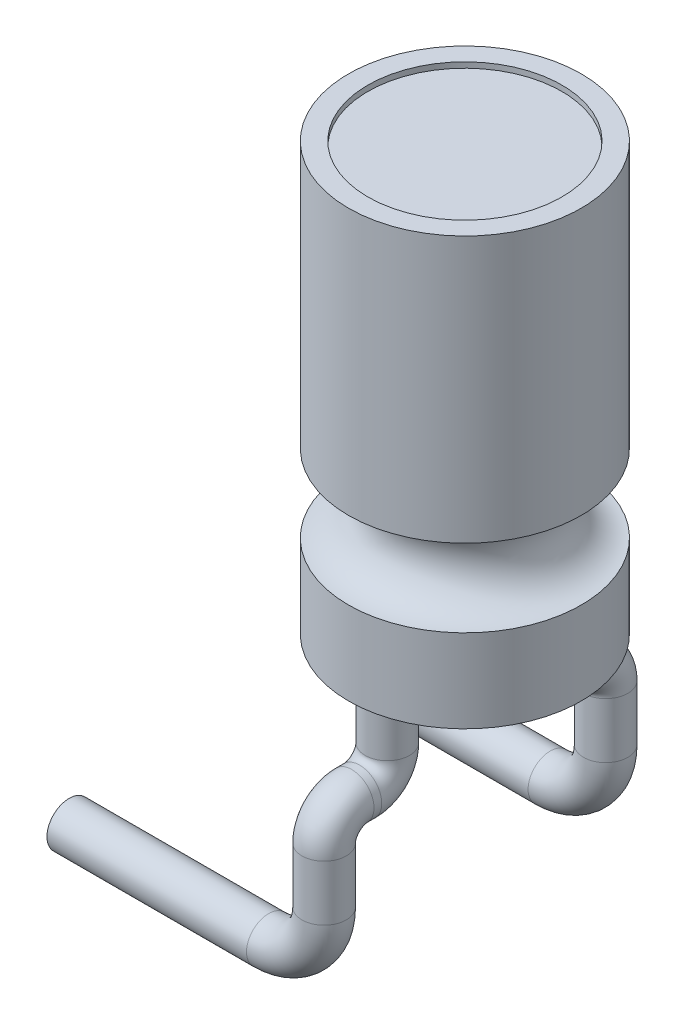
ISO-10303-21;
HEADER;
FILE_DESCRIPTION(('STEP AP214'),'2;1');
FILE_NAME('part.step','',(''),(''),'','','');
FILE_SCHEMA(('AUTOMOTIVE_DESIGN { 1 0 10303 214 1 1 1 1 }'));
ENDSEC;
DATA;
#1=APPLICATION_CONTEXT('core data for automotive mechanical design processes');
#2=APPLICATION_PROTOCOL_DEFINITION('international standard','automotive_design',2000,#1);
#3=PRODUCT_CONTEXT('',#1,'mechanical');
#4=PRODUCT('Part','Part','',(#3));
#5=PRODUCT_RELATED_PRODUCT_CATEGORY('part','',(#4));
#6=PRODUCT_DEFINITION_FORMATION('','',#4);
#7=PRODUCT_DEFINITION_CONTEXT('part definition',#1,'design');
#8=PRODUCT_DEFINITION('design','',#6,#7);
#9=PRODUCT_DEFINITION_SHAPE('','',#8);
#10=(LENGTH_UNIT() NAMED_UNIT(*) SI_UNIT(.MILLI.,.METRE.));
#11=(NAMED_UNIT(*) PLANE_ANGLE_UNIT() SI_UNIT($,.RADIAN.));
#12=(NAMED_UNIT(*) SI_UNIT($,.STERADIAN.) SOLID_ANGLE_UNIT());
#13=UNCERTAINTY_MEASURE_WITH_UNIT(LENGTH_MEASURE(1.E-05),#10,'distance_accuracy_value','');
#14=(GEOMETRIC_REPRESENTATION_CONTEXT(3) GLOBAL_UNCERTAINTY_ASSIGNED_CONTEXT((#13)) GLOBAL_UNIT_ASSIGNED_CONTEXT((#10,
#11,#12)) REPRESENTATION_CONTEXT('',''));
#15=CARTESIAN_POINT('',(0.,0.,0.));
#16=DIRECTION('',(0.,0.,1.));
#17=DIRECTION('',(1.,0.,0.));
#18=AXIS2_PLACEMENT_3D('',#15,#16,#17);
#19=CARTESIAN_POINT('',(2.1,27.5164236634825,0.));
#20=DIRECTION('',(0.,1.,0.));
#21=DIRECTION('',(0.,0.,1.));
#22=AXIS2_PLACEMENT_3D('',#19,#20,#21);
#23=PLANE('',#22);
#24=CARTESIAN_POINT('',(0.,27.5164236634825,-1.4));
#25=DIRECTION('',(0.,1.,0.));
#26=DIRECTION('',(0.,0.,1.));
#27=AXIS2_PLACEMENT_3D('',#24,#25,#26);
#28=CIRCLE('',#27,0.4);
#29=CARTESIAN_POINT('',(0.,27.5164236634825,-1.));
#30=VERTEX_POINT('',#29);
#31=EDGE_CURVE('E84',#30,#30,#28,.T.);
#32=ORIENTED_EDGE('',*,*,#31,.T.);
#33=EDGE_LOOP('',(#32));
#34=FACE_BOUND('',#33,.T.);
#35=CARTESIAN_POINT('',(0.,27.5164236634825,0.));
#36=DIRECTION('',(0.,1.,0.));
#37=DIRECTION('',(0.,0.,1.));
#38=AXIS2_PLACEMENT_3D('',#35,#36,#37);
#39=CIRCLE('',#38,2.1);
#40=CARTESIAN_POINT('',(0.,27.5164236634825,2.1));
#41=VERTEX_POINT('',#40);
#42=EDGE_CURVE('E32',#41,#41,#39,.T.);
#43=ORIENTED_EDGE('',*,*,#42,.F.);
#44=EDGE_LOOP('',(#43));
#45=FACE_BOUND('',#44,.T.);
#46=CARTESIAN_POINT('',(0.,27.5164236634825,1.4));
#47=DIRECTION('',(0.,1.,0.));
#48=DIRECTION('',(0.,0.,1.));
#49=AXIS2_PLACEMENT_3D('',#46,#47,#48);
#50=CIRCLE('',#49,0.4);
#51=CARTESIAN_POINT('',(0.,27.5164236634825,1.8));
#52=VERTEX_POINT('',#51);
#53=EDGE_CURVE('E10',#52,#52,#50,.F.);
#54=ORIENTED_EDGE('',*,*,#53,.F.);
#55=EDGE_LOOP('',(#54));
#56=FACE_BOUND('',#55,.T.);
#57=ADVANCED_FACE('F26',(#34,#45,#56),#23,.F.);
#58=CARTESIAN_POINT('',(0.,48.4017094017094,0.));
#59=DIRECTION('',(0.,1.,0.));
#60=DIRECTION('',(0.,0.,1.));
#61=AXIS2_PLACEMENT_3D('',#58,#59,#60);
#62=CYLINDRICAL_SURFACE('',#61,2.1);
#63=CARTESIAN_POINT('',(0.,29.0164236634825,0.));
#64=DIRECTION('',(0.,1.,0.));
#65=DIRECTION('',(0.,0.,1.));
#66=AXIS2_PLACEMENT_3D('',#63,#64,#65);
#67=CIRCLE('',#66,2.1);
#68=CARTESIAN_POINT('',(0.,29.0164236634825,2.1));
#69=VERTEX_POINT('',#68);
#70=EDGE_CURVE('E36',#69,#69,#67,.T.);
#71=ORIENTED_EDGE('',*,*,#70,.F.);
#72=EDGE_LOOP('',(#71));
#73=FACE_BOUND('',#72,.T.);
#74=ORIENTED_EDGE('',*,*,#42,.T.);
#75=EDGE_LOOP('',(#74));
#76=FACE_BOUND('',#75,.T.);
#77=ADVANCED_FACE('F118',(#73,#76),#62,.T.);
#78=CARTESIAN_POINT('',(0.,29.7164236634825,0.));
#79=DIRECTION('',(0.,1.,0.));
#80=DIRECTION('',(0.,0.,1.));
#81=AXIS2_PLACEMENT_3D('',#78,#79,#80);
#82=TOROIDAL_SURFACE('',#81,2.1,0.699999999999999);
#83=CARTESIAN_POINT('',(0.,30.4164236634825,0.));
#84=DIRECTION('',(0.,1.,0.));
#85=DIRECTION('',(0.,0.,1.));
#86=AXIS2_PLACEMENT_3D('',#83,#84,#85);
#87=CIRCLE('',#86,2.1);
#88=CARTESIAN_POINT('',(0.,30.4164236634825,2.1));
#89=VERTEX_POINT('',#88);
#90=EDGE_CURVE('E40',#89,#89,#87,.T.);
#91=ORIENTED_EDGE('',*,*,#90,.F.);
#92=EDGE_LOOP('',(#91));
#93=FACE_BOUND('',#92,.T.);
#94=ORIENTED_EDGE('',*,*,#70,.T.);
#95=EDGE_LOOP('',(#94));
#96=FACE_BOUND('',#95,.T.);
#97=ADVANCED_FACE('F125',(#93,#96),#82,.F.);
#98=CARTESIAN_POINT('',(0.,48.4017094017094,0.));
#99=DIRECTION('',(0.,1.,0.));
#100=DIRECTION('',(0.,0.,1.));
#101=AXIS2_PLACEMENT_3D('',#98,#99,#100);
#102=CYLINDRICAL_SURFACE('',#101,2.1);
#103=CARTESIAN_POINT('',(0.,35.2164236634825,0.));
#104=DIRECTION('',(0.,1.,0.));
#105=DIRECTION('',(0.,0.,1.));
#106=AXIS2_PLACEMENT_3D('',#103,#104,#105);
#107=CIRCLE('',#106,2.1);
#108=CARTESIAN_POINT('',(0.,35.2164236634825,2.1));
#109=VERTEX_POINT('',#108);
#110=EDGE_CURVE('E45',#109,#109,#107,.T.);
#111=ORIENTED_EDGE('',*,*,#110,.F.);
#112=EDGE_LOOP('',(#111));
#113=FACE_BOUND('',#112,.T.);
#114=ORIENTED_EDGE('',*,*,#90,.T.);
#115=EDGE_LOOP('',(#114));
#116=FACE_BOUND('',#115,.T.);
#117=ADVANCED_FACE('F193',(#113,#116),#102,.T.);
#118=CARTESIAN_POINT('',(0.,35.2164236634825,0.));
#119=DIRECTION('',(0.,-1.,0.));
#120=DIRECTION('',(0.,0.,-1.));
#121=AXIS2_PLACEMENT_3D('',#118,#119,#120);
#122=PLANE('',#121);
#123=CARTESIAN_POINT('',(0.,35.2164236634825,0.));
#124=DIRECTION('',(0.,1.,0.));
#125=DIRECTION('',(0.,0.,1.));
#126=AXIS2_PLACEMENT_3D('',#123,#124,#125);
#127=CIRCLE('',#126,1.75);
#128=CARTESIAN_POINT('',(0.,35.2164236634825,1.75));
#129=VERTEX_POINT('',#128);
#130=EDGE_CURVE('E51',#129,#129,#127,.T.);
#131=ORIENTED_EDGE('',*,*,#130,.F.);
#132=EDGE_LOOP('',(#131));
#133=FACE_BOUND('',#132,.T.);
#134=ORIENTED_EDGE('',*,*,#110,.T.);
#135=EDGE_LOOP('',(#134));
#136=FACE_BOUND('',#135,.T.);
#137=ADVANCED_FACE('F189',(#133,#136),#122,.F.);
#138=CARTESIAN_POINT('',(0.,35.1164236634825,0.));
#139=DIRECTION('',(0.,1.,0.));
#140=DIRECTION('',(0.,0.,1.));
#141=AXIS2_PLACEMENT_3D('',#138,#139,#140);
#142=CYLINDRICAL_SURFACE('',#141,1.75);
#143=CARTESIAN_POINT('',(0.,35.1164236634825,0.));
#144=DIRECTION('',(0.,1.,0.));
#145=DIRECTION('',(0.,0.,1.));
#146=AXIS2_PLACEMENT_3D('',#143,#144,#145);
#147=CIRCLE('',#146,1.75);
#148=CARTESIAN_POINT('',(0.,35.1164236634825,1.75));
#149=VERTEX_POINT('',#148);
#150=EDGE_CURVE('E48',#149,#149,#147,.T.);
#151=ORIENTED_EDGE('',*,*,#150,.F.);
#152=EDGE_LOOP('',(#151));
#153=FACE_BOUND('',#152,.T.);
#154=ORIENTED_EDGE('',*,*,#130,.T.);
#155=EDGE_LOOP('',(#154));
#156=FACE_BOUND('',#155,.T.);
#157=ADVANCED_FACE('F185',(#153,#156),#142,.F.);
#158=CARTESIAN_POINT('',(0.,35.1164236634825,0.));
#159=DIRECTION('',(0.,1.,0.));
#160=DIRECTION('',(0.,0.,1.));
#161=AXIS2_PLACEMENT_3D('',#158,#159,#160);
#162=PLANE('',#161);
#163=ORIENTED_EDGE('',*,*,#150,.T.);
#164=EDGE_LOOP('',(#163));
#165=FACE_BOUND('',#164,.T.);
#166=ADVANCED_FACE('F181',(#165),#162,.T.);
#167=CARTESIAN_POINT('',(0.,25.5164236634825,2.04));
#168=DIRECTION('',(1.,0.,0.));
#169=DIRECTION('',(0.,0.,-1.));
#170=AXIS2_PLACEMENT_3D('',#167,#168,#169);
#171=TOROIDAL_SURFACE('',#170,0.500000000000004,0.4);
#172=CARTESIAN_POINT('',(0.,26.0164236634825,2.04));
#173=DIRECTION('',(0.,0.,1.));
#174=DIRECTION('',(0.,-1.,0.));
#175=AXIS2_PLACEMENT_3D('',#172,#173,#174);
#176=CIRCLE('',#175,0.4);
#177=CARTESIAN_POINT('',(0.,26.4164236634825,2.03999999999999));
#178=VERTEX_POINT('',#177);
#179=EDGE_CURVE('E57',#178,#178,#176,.T.);
#180=CARTESIAN_POINT('',(0.,25.5164236634825,2.54));
#181=DIRECTION('',(0.,-1.,0.));
#182=DIRECTION('',(0.,0.,-1.));
#183=AXIS2_PLACEMENT_3D('',#180,#181,#182);
#184=CIRCLE('',#183,0.4);
#185=CARTESIAN_POINT('',(0.,25.5164236634825,2.94));
#186=VERTEX_POINT('',#185);
#187=EDGE_CURVE('E54',#186,#186,#184,.T.);
#188=CARTESIAN_POINT('',(0.,25.5164236634825,2.04));
#189=DIRECTION('',(1.,0.,0.));
#190=DIRECTION('',(0.,0.,-1.));
#191=AXIS2_PLACEMENT_3D('',#188,#189,#190);
#192=CIRCLE('',#191,0.900000000000004);
#193=EDGE_CURVE('',#178,#186,#192,.T.);
#194=ORIENTED_EDGE('',*,*,#179,.T.);
#195=ORIENTED_EDGE('',*,*,#187,.F.);
#196=ORIENTED_EDGE('',*,*,#193,.T.);
#197=ORIENTED_EDGE('',*,*,#193,.F.);
#198=EDGE_LOOP('',(#194,#196,#195,#197));
#199=FACE_BOUND('',#198,.T.);
#200=ADVANCED_FACE('F177',(#199),#171,.T.);
#201=CARTESIAN_POINT('',(0.,26.0164236634825,1.9));
#202=DIRECTION('',(0.,0.,1.));
#203=DIRECTION('',(1.,0.,0.));
#204=AXIS2_PLACEMENT_3D('',#201,#202,#203);
#205=CYLINDRICAL_SURFACE('',#204,0.4);
#206=CARTESIAN_POINT('',(0.,26.0164236634825,1.9));
#207=DIRECTION('',(0.,0.,1.));
#208=DIRECTION('',(0.,-1.,0.));
#209=AXIS2_PLACEMENT_3D('',#206,#207,#208);
#210=CIRCLE('',#209,0.4);
#211=CARTESIAN_POINT('',(0.,25.6164236634825,1.9));
#212=VERTEX_POINT('',#211);
#213=EDGE_CURVE('E60',#212,#212,#210,.T.);
#214=ORIENTED_EDGE('',*,*,#213,.T.);
#215=EDGE_LOOP('',(#214));
#216=FACE_BOUND('',#215,.T.);
#217=ORIENTED_EDGE('',*,*,#179,.F.);
#218=EDGE_LOOP('',(#217));
#219=FACE_BOUND('',#218,.T.);
#220=ADVANCED_FACE('F173',(#216,#219),#205,.T.);
#221=CARTESIAN_POINT('',(0.,26.5164236634825,1.9));
#222=DIRECTION('',(-1.,0.,0.));
#223=DIRECTION('',(0.,0.,1.));
#224=AXIS2_PLACEMENT_3D('',#221,#222,#223);
#225=TOROIDAL_SURFACE('',#224,0.5,0.4);
#226=CARTESIAN_POINT('',(0.,26.5164236634825,1.4));
#227=DIRECTION('',(0.,-1.,0.));
#228=DIRECTION('',(0.,0.,-1.));
#229=AXIS2_PLACEMENT_3D('',#226,#227,#228);
#230=CIRCLE('',#229,0.4);
#231=CARTESIAN_POINT('',(0.,26.5164236634825,1.));
#232=VERTEX_POINT('',#231);
#233=EDGE_CURVE('E63',#232,#232,#230,.T.);
#234=CARTESIAN_POINT('',(0.,26.5164236634825,1.9));
#235=DIRECTION('',(-1.,0.,0.));
#236=DIRECTION('',(0.,0.,1.));
#237=AXIS2_PLACEMENT_3D('',#234,#235,#236);
#238=CIRCLE('',#237,0.9);
#239=EDGE_CURVE('',#232,#212,#238,.T.);
#240=ORIENTED_EDGE('',*,*,#233,.T.);
#241=ORIENTED_EDGE('',*,*,#213,.F.);
#242=ORIENTED_EDGE('',*,*,#239,.T.);
#243=ORIENTED_EDGE('',*,*,#239,.F.);
#244=EDGE_LOOP('',(#240,#242,#241,#243));
#245=FACE_BOUND('',#244,.T.);
#246=ADVANCED_FACE('F169',(#245),#225,.T.);
#247=CARTESIAN_POINT('',(0.,26.5164236634825,1.4));
#248=DIRECTION('',(0.,1.,0.));
#249=DIRECTION('',(0.,0.,1.));
#250=AXIS2_PLACEMENT_3D('',#247,#248,#249);
#251=CYLINDRICAL_SURFACE('',#250,0.4);
#252=ORIENTED_EDGE('',*,*,#233,.F.);
#253=EDGE_LOOP('',(#252));
#254=FACE_BOUND('',#253,.T.);
#255=ORIENTED_EDGE('',*,*,#53,.T.);
#256=EDGE_LOOP('',(#255));
#257=FACE_BOUND('',#256,.T.);
#258=ADVANCED_FACE('F165',(#254,#257),#251,.T.);
#259=CARTESIAN_POINT('',(-1.00000000000001,23.5164236634825,2.54));
#260=DIRECTION('',(-1.,0.,0.));
#261=DIRECTION('',(0.,0.,1.));
#262=AXIS2_PLACEMENT_3D('',#259,#260,#261);
#263=CYLINDRICAL_SURFACE('',#262,0.4);
#264=CARTESIAN_POINT('',(-1.00000000000001,23.5164236634825,2.54));
#265=DIRECTION('',(-1.,0.,0.));
#266=DIRECTION('',(0.,0.,-1.));
#267=AXIS2_PLACEMENT_3D('',#264,#265,#266);
#268=CIRCLE('',#267,0.4);
#269=CARTESIAN_POINT('',(-1.00000000000001,23.1164236634825,2.54));
#270=VERTEX_POINT('',#269);
#271=EDGE_CURVE('E69',#270,#270,#268,.T.);
#272=ORIENTED_EDGE('',*,*,#271,.T.);
#273=EDGE_LOOP('',(#272));
#274=FACE_BOUND('',#273,.T.);
#275=CARTESIAN_POINT('',(-4.6,23.5164236634825,2.54));
#276=DIRECTION('',(-1.,0.,0.));
#277=DIRECTION('',(0.,0.,-1.));
#278=AXIS2_PLACEMENT_3D('',#275,#276,#277);
#279=CIRCLE('',#278,0.4);
#280=CARTESIAN_POINT('',(-4.6,23.5164236634825,2.14));
#281=VERTEX_POINT('',#280);
#282=EDGE_CURVE('E66',#281,#281,#279,.T.);
#283=ORIENTED_EDGE('',*,*,#282,.F.);
#284=EDGE_LOOP('',(#283));
#285=FACE_BOUND('',#284,.T.);
#286=ADVANCED_FACE('F161',(#274,#285),#263,.T.);
#287=CARTESIAN_POINT('',(-1.,24.5164236634825,2.54));
#288=DIRECTION('',(0.,0.,-1.));
#289=DIRECTION('',(-1.,0.,0.));
#290=AXIS2_PLACEMENT_3D('',#287,#288,#289);
#291=TOROIDAL_SURFACE('',#290,1.,0.4);
#292=CARTESIAN_POINT('',(0.,24.5164236634825,2.54));
#293=DIRECTION('',(0.,-1.,0.));
#294=DIRECTION('',(0.,0.,-1.));
#295=AXIS2_PLACEMENT_3D('',#292,#293,#294);
#296=CIRCLE('',#295,0.4);
#297=CARTESIAN_POINT('',(0.4,24.5164236634825,2.54));
#298=VERTEX_POINT('',#297);
#299=EDGE_CURVE('E72',#298,#298,#296,.T.);
#300=CARTESIAN_POINT('',(-1.,24.5164236634825,2.54));
#301=DIRECTION('',(0.,0.,-1.));
#302=DIRECTION('',(-1.,0.,0.));
#303=AXIS2_PLACEMENT_3D('',#300,#301,#302);
#304=CIRCLE('',#303,1.4);
#305=EDGE_CURVE('',#298,#270,#304,.T.);
#306=ORIENTED_EDGE('',*,*,#299,.T.);
#307=ORIENTED_EDGE('',*,*,#271,.F.);
#308=ORIENTED_EDGE('',*,*,#305,.T.);
#309=ORIENTED_EDGE('',*,*,#305,.F.);
#310=EDGE_LOOP('',(#306,#308,#307,#309));
#311=FACE_BOUND('',#310,.T.);
#312=ADVANCED_FACE('F157',(#311),#291,.T.);
#313=CARTESIAN_POINT('',(0.,24.5164236634825,2.54));
#314=DIRECTION('',(0.,1.,0.));
#315=DIRECTION('',(-1.,0.,0.));
#316=AXIS2_PLACEMENT_3D('',#313,#314,#315);
#317=CYLINDRICAL_SURFACE('',#316,0.4);
#318=ORIENTED_EDGE('',*,*,#299,.F.);
#319=EDGE_LOOP('',(#318));
#320=FACE_BOUND('',#319,.T.);
#321=ORIENTED_EDGE('',*,*,#187,.T.);
#322=EDGE_LOOP('',(#321));
#323=FACE_BOUND('',#322,.T.);
#324=ADVANCED_FACE('F153',(#320,#323),#317,.T.);
#325=CARTESIAN_POINT('',(-4.6,23.5164236634825,2.54));
#326=DIRECTION('',(-1.,0.,0.));
#327=DIRECTION('',(0.,0.,-1.));
#328=AXIS2_PLACEMENT_3D('',#325,#326,#327);
#329=PLANE('',#328);
#330=ORIENTED_EDGE('',*,*,#282,.T.);
#331=EDGE_LOOP('',(#330));
#332=FACE_BOUND('',#331,.T.);
#333=ADVANCED_FACE('F150',(#332),#329,.T.);
#334=CARTESIAN_POINT('',(0.,25.5164236634825,-2.04));
#335=DIRECTION('',(-1.,0.,0.));
#336=DIRECTION('',(0.,0.,1.));
#337=AXIS2_PLACEMENT_3D('',#334,#335,#336);
#338=TOROIDAL_SURFACE('',#337,0.500000000000004,0.4);
#339=CARTESIAN_POINT('',(0.,26.0164236634825,-2.04));
#340=DIRECTION('',(0.,0.,1.));
#341=DIRECTION('',(0.,-1.,0.));
#342=AXIS2_PLACEMENT_3D('',#339,#340,#341);
#343=CIRCLE('',#342,0.4);
#344=CARTESIAN_POINT('',(0.,26.4164236634825,-2.03999999999999));
#345=VERTEX_POINT('',#344);
#346=EDGE_CURVE('E75',#345,#345,#343,.T.);
#347=CARTESIAN_POINT('',(0.,25.5164236634825,-2.54));
#348=DIRECTION('',(0.,1.,0.));
#349=DIRECTION('',(0.,0.,1.));
#350=AXIS2_PLACEMENT_3D('',#347,#348,#349);
#351=CIRCLE('',#350,0.4);
#352=CARTESIAN_POINT('',(0.,25.5164236634825,-2.94));
#353=VERTEX_POINT('',#352);
#354=EDGE_CURVE('E96',#353,#353,#351,.T.);
#355=CARTESIAN_POINT('',(0.,25.5164236634825,-2.04));
#356=DIRECTION('',(-1.,0.,0.));
#357=DIRECTION('',(0.,0.,1.));
#358=AXIS2_PLACEMENT_3D('',#355,#356,#357);
#359=CIRCLE('',#358,0.900000000000004);
#360=EDGE_CURVE('',#345,#353,#359,.T.);
#361=ORIENTED_EDGE('',*,*,#346,.F.);
#362=ORIENTED_EDGE('',*,*,#354,.T.);
#363=ORIENTED_EDGE('',*,*,#360,.T.);
#364=ORIENTED_EDGE('',*,*,#360,.F.);
#365=EDGE_LOOP('',(#361,#363,#362,#364));
#366=FACE_BOUND('',#365,.T.);
#367=ADVANCED_FACE('F100',(#366),#338,.T.);
#368=CARTESIAN_POINT('',(0.,26.0164236634825,-1.9));
#369=DIRECTION('',(0.,0.,-1.));
#370=DIRECTION('',(-1.,0.,0.));
#371=AXIS2_PLACEMENT_3D('',#368,#369,#370);
#372=CYLINDRICAL_SURFACE('',#371,0.4);
#373=CARTESIAN_POINT('',(0.,26.0164236634825,-1.9));
#374=DIRECTION('',(0.,0.,1.));
#375=DIRECTION('',(0.,-1.,0.));
#376=AXIS2_PLACEMENT_3D('',#373,#374,#375);
#377=CIRCLE('',#376,0.4);
#378=CARTESIAN_POINT('',(0.,25.6164236634825,-1.9));
#379=VERTEX_POINT('',#378);
#380=EDGE_CURVE('E78',#379,#379,#377,.T.);
#381=ORIENTED_EDGE('',*,*,#380,.F.);
#382=EDGE_LOOP('',(#381));
#383=FACE_BOUND('',#382,.T.);
#384=ORIENTED_EDGE('',*,*,#346,.T.);
#385=EDGE_LOOP('',(#384));
#386=FACE_BOUND('',#385,.T.);
#387=ADVANCED_FACE('F142',(#383,#386),#372,.T.);
#388=CARTESIAN_POINT('',(0.,26.5164236634825,-1.9));
#389=DIRECTION('',(1.,0.,0.));
#390=DIRECTION('',(0.,0.,-1.));
#391=AXIS2_PLACEMENT_3D('',#388,#389,#390);
#392=TOROIDAL_SURFACE('',#391,0.5,0.4);
#393=CARTESIAN_POINT('',(0.,26.5164236634825,-1.4));
#394=DIRECTION('',(0.,1.,0.));
#395=DIRECTION('',(0.,0.,1.));
#396=AXIS2_PLACEMENT_3D('',#393,#394,#395);
#397=CIRCLE('',#396,0.4);
#398=CARTESIAN_POINT('',(0.,26.5164236634825,-1.));
#399=VERTEX_POINT('',#398);
#400=EDGE_CURVE('E81',#399,#399,#397,.T.);
#401=CARTESIAN_POINT('',(0.,26.5164236634825,-1.9));
#402=DIRECTION('',(1.,0.,0.));
#403=DIRECTION('',(0.,0.,-1.));
#404=AXIS2_PLACEMENT_3D('',#401,#402,#403);
#405=CIRCLE('',#404,0.9);
#406=EDGE_CURVE('',#399,#379,#405,.T.);
#407=ORIENTED_EDGE('',*,*,#400,.F.);
#408=ORIENTED_EDGE('',*,*,#380,.T.);
#409=ORIENTED_EDGE('',*,*,#406,.T.);
#410=ORIENTED_EDGE('',*,*,#406,.F.);
#411=EDGE_LOOP('',(#407,#409,#408,#410));
#412=FACE_BOUND('',#411,.T.);
#413=ADVANCED_FACE('F133',(#412),#392,.T.);
#414=CARTESIAN_POINT('',(0.,26.5164236634825,-1.4));
#415=DIRECTION('',(0.,1.,0.));
#416=DIRECTION('',(0.,0.,1.));
#417=AXIS2_PLACEMENT_3D('',#414,#415,#416);
#418=CYLINDRICAL_SURFACE('',#417,0.4);
#419=ORIENTED_EDGE('',*,*,#400,.T.);
#420=EDGE_LOOP('',(#419));
#421=FACE_BOUND('',#420,.T.);
#422=ORIENTED_EDGE('',*,*,#31,.F.);
#423=EDGE_LOOP('',(#422));
#424=FACE_BOUND('',#423,.T.);
#425=ADVANCED_FACE('F131',(#421,#424),#418,.T.);
#426=CARTESIAN_POINT('',(-1.00000000000001,23.5164236634825,-2.54));
#427=DIRECTION('',(-1.,0.,0.));
#428=DIRECTION('',(0.,0.,1.));
#429=AXIS2_PLACEMENT_3D('',#426,#427,#428);
#430=CYLINDRICAL_SURFACE('',#429,0.4);
#431=CARTESIAN_POINT('',(-1.00000000000001,23.5164236634825,-2.54));
#432=DIRECTION('',(1.,0.,0.));
#433=DIRECTION('',(0.,0.,1.));
#434=AXIS2_PLACEMENT_3D('',#431,#432,#433);
#435=CIRCLE('',#434,0.4);
#436=CARTESIAN_POINT('',(-1.00000000000001,23.1164236634825,-2.54));
#437=VERTEX_POINT('',#436);
#438=EDGE_CURVE('E90',#437,#437,#435,.T.);
#439=ORIENTED_EDGE('',*,*,#438,.F.);
#440=EDGE_LOOP('',(#439));
#441=FACE_BOUND('',#440,.T.);
#442=CARTESIAN_POINT('',(-4.6,23.5164236634825,-2.54));
#443=DIRECTION('',(1.,0.,0.));
#444=DIRECTION('',(0.,0.,1.));
#445=AXIS2_PLACEMENT_3D('',#442,#443,#444);
#446=CIRCLE('',#445,0.4);
#447=CARTESIAN_POINT('',(-4.6,23.5164236634825,-2.14));
#448=VERTEX_POINT('',#447);
#449=EDGE_CURVE('E87',#448,#448,#446,.T.);
#450=ORIENTED_EDGE('',*,*,#449,.T.);
#451=EDGE_LOOP('',(#450));
#452=FACE_BOUND('',#451,.T.);
#453=ADVANCED_FACE('F114',(#441,#452),#430,.T.);
#454=CARTESIAN_POINT('',(-1.,24.5164236634825,-2.54));
#455=DIRECTION('',(0.,0.,-1.));
#456=DIRECTION('',(-1.,0.,0.));
#457=AXIS2_PLACEMENT_3D('',#454,#455,#456);
#458=TOROIDAL_SURFACE('',#457,1.,0.4);
#459=CARTESIAN_POINT('',(0.,24.5164236634825,-2.54));
#460=DIRECTION('',(0.,1.,0.));
#461=DIRECTION('',(0.,0.,1.));
#462=AXIS2_PLACEMENT_3D('',#459,#460,#461);
#463=CIRCLE('',#462,0.4);
#464=CARTESIAN_POINT('',(0.4,24.5164236634825,-2.54));
#465=VERTEX_POINT('',#464);
#466=EDGE_CURVE('E93',#465,#465,#463,.T.);
#467=CARTESIAN_POINT('',(-1.,24.5164236634825,-2.54));
#468=DIRECTION('',(0.,0.,-1.));
#469=DIRECTION('',(-1.,0.,0.));
#470=AXIS2_PLACEMENT_3D('',#467,#468,#469);
#471=CIRCLE('',#470,1.4);
#472=EDGE_CURVE('',#465,#437,#471,.T.);
#473=ORIENTED_EDGE('',*,*,#466,.F.);
#474=ORIENTED_EDGE('',*,*,#438,.T.);
#475=ORIENTED_EDGE('',*,*,#472,.T.);
#476=ORIENTED_EDGE('',*,*,#472,.F.);
#477=EDGE_LOOP('',(#473,#475,#474,#476));
#478=FACE_BOUND('',#477,.T.);
#479=ADVANCED_FACE('F105',(#478),#458,.T.);
#480=CARTESIAN_POINT('',(0.,24.5164236634825,-2.54));
#481=DIRECTION('',(0.,1.,0.));
#482=DIRECTION('',(-1.,0.,0.));
#483=AXIS2_PLACEMENT_3D('',#480,#481,#482);
#484=CYLINDRICAL_SURFACE('',#483,0.4);
#485=ORIENTED_EDGE('',*,*,#466,.T.);
#486=EDGE_LOOP('',(#485));
#487=FACE_BOUND('',#486,.T.);
#488=ORIENTED_EDGE('',*,*,#354,.F.);
#489=EDGE_LOOP('',(#488));
#490=FACE_BOUND('',#489,.T.);
#491=ADVANCED_FACE('F102',(#487,#490),#484,.T.);
#492=CARTESIAN_POINT('',(-4.6,23.5164236634825,-2.54));
#493=DIRECTION('',(-1.,0.,0.));
#494=DIRECTION('',(0.,0.,1.));
#495=AXIS2_PLACEMENT_3D('',#492,#493,#494);
#496=PLANE('',#495);
#497=ORIENTED_EDGE('',*,*,#449,.F.);
#498=EDGE_LOOP('',(#497));
#499=FACE_BOUND('',#498,.T.);
#500=ADVANCED_FACE('F104',(#499),#496,.T.);
#501=CLOSED_SHELL('',(#57,#77,#97,#117,#137,#157,#166,#200,#220,#246,#258,#286,#312,#324,#333,
#367,#387,#413,#425,#453,#479,#491,#500));
#502=MANIFOLD_SOLID_BREP('B2',#501);
#503=ADVANCED_BREP_SHAPE_REPRESENTATION('',(#18,#502),#14);
#504=SHAPE_DEFINITION_REPRESENTATION(#9,#503);
ENDSEC;
END-ISO-10303-21;
